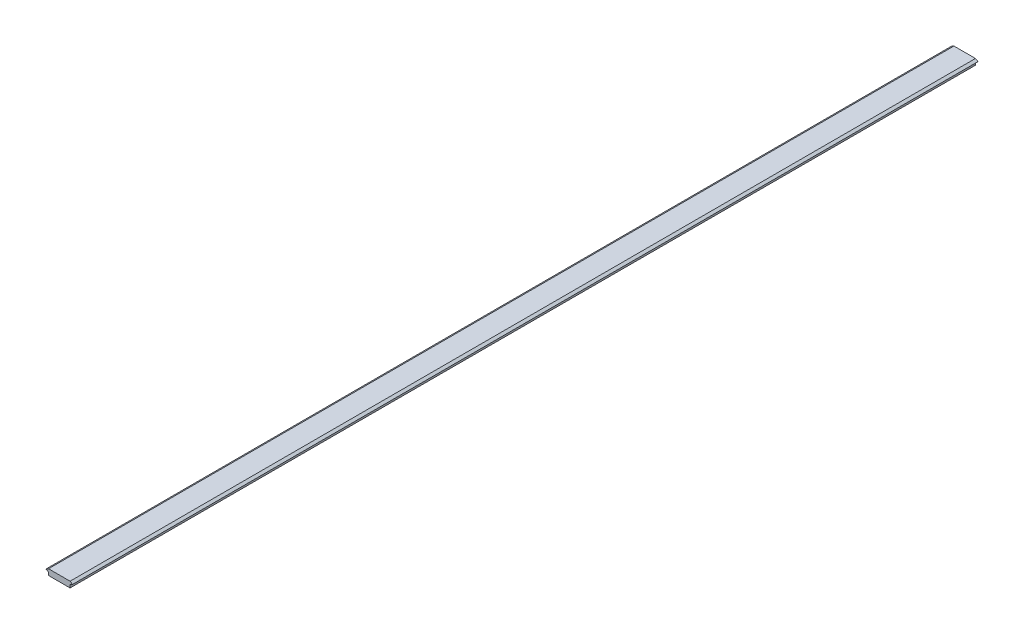
ISO-10303-21;
HEADER;
FILE_DESCRIPTION(('STEP AP214'),'2;1');
FILE_NAME('part.step','',(''),(''),'','','');
FILE_SCHEMA(('AUTOMOTIVE_DESIGN { 1 0 10303 214 1 1 1 1 }'));
ENDSEC;
DATA;
#1=APPLICATION_CONTEXT('core data for automotive mechanical design processes');
#2=APPLICATION_PROTOCOL_DEFINITION('international standard','automotive_design',2000,#1);
#3=PRODUCT_CONTEXT('',#1,'mechanical');
#4=PRODUCT('Part','Part','',(#3));
#5=PRODUCT_RELATED_PRODUCT_CATEGORY('part','',(#4));
#6=PRODUCT_DEFINITION_FORMATION('','',#4);
#7=PRODUCT_DEFINITION_CONTEXT('part definition',#1,'design');
#8=PRODUCT_DEFINITION('design','',#6,#7);
#9=PRODUCT_DEFINITION_SHAPE('','',#8);
#10=(LENGTH_UNIT() NAMED_UNIT(*) SI_UNIT(.MILLI.,.METRE.));
#11=(NAMED_UNIT(*) PLANE_ANGLE_UNIT() SI_UNIT($,.RADIAN.));
#12=(NAMED_UNIT(*) SI_UNIT($,.STERADIAN.) SOLID_ANGLE_UNIT());
#13=UNCERTAINTY_MEASURE_WITH_UNIT(LENGTH_MEASURE(1.E-05),#10,'distance_accuracy_value','');
#14=(GEOMETRIC_REPRESENTATION_CONTEXT(3) GLOBAL_UNCERTAINTY_ASSIGNED_CONTEXT((#13)) GLOBAL_UNIT_ASSIGNED_CONTEXT((#10,
#11,#12)) REPRESENTATION_CONTEXT('',''));
#15=CARTESIAN_POINT('',(0.,0.,0.));
#16=DIRECTION('',(0.,0.,1.));
#17=DIRECTION('',(1.,0.,0.));
#18=AXIS2_PLACEMENT_3D('',#15,#16,#17);
#19=CARTESIAN_POINT('',(-2.59807621135333,-1.5,925.));
#20=DIRECTION('',(0.499999999999998,-0.86602540378444,0.));
#21=DIRECTION('',(0.86602540378444,0.499999999999998,0.));
#22=AXIS2_PLACEMENT_3D('',#19,#20,#21);
#23=PLANE('',#22);
#24=DIRECTION('',(-0.86602540378444,-0.499999999999998,0.));
#25=VECTOR('',#24,1.);
#26=CARTESIAN_POINT('',(-2.59807621135333,-1.5,0.));
#27=LINE('',#26,#25);
#28=CARTESIAN_POINT('',(0.,0.,0.));
#29=VERTEX_POINT('',#28);
#30=CARTESIAN_POINT('',(-2.59807621135333,-1.5,0.));
#31=VERTEX_POINT('',#30);
#32=EDGE_CURVE('E133',#29,#31,#27,.T.);
#33=ORIENTED_EDGE('',*,*,#32,.T.);
#34=DIRECTION('',(0.,0.,-1.));
#35=VECTOR('',#34,1.);
#36=CARTESIAN_POINT('',(-2.59807621135333,-1.5,925.));
#37=LINE('',#36,#35);
#38=CARTESIAN_POINT('',(-2.59807621135333,-1.5,925.));
#39=VERTEX_POINT('',#38);
#40=EDGE_CURVE('E11',#39,#31,#37,.T.);
#41=ORIENTED_EDGE('',*,*,#40,.F.);
#42=DIRECTION('',(-0.86602540378444,-0.499999999999998,0.));
#43=VECTOR('',#42,1.);
#44=CARTESIAN_POINT('',(-2.59807621135333,-1.5,925.));
#45=LINE('',#44,#43);
#46=CARTESIAN_POINT('',(0.,0.,925.));
#47=VERTEX_POINT('',#46);
#48=EDGE_CURVE('E147',#47,#39,#45,.T.);
#49=ORIENTED_EDGE('',*,*,#48,.F.);
#50=DIRECTION('',(0.,0.,-1.));
#51=VECTOR('',#50,1.);
#52=CARTESIAN_POINT('',(0.,0.,925.));
#53=LINE('',#52,#51);
#54=EDGE_CURVE('E129',#47,#29,#53,.T.);
#55=ORIENTED_EDGE('',*,*,#54,.T.);
#56=EDGE_LOOP('',(#33,#41,#49,#55));
#57=FACE_BOUND('',#56,.T.);
#58=ADVANCED_FACE('F37',(#57),#23,.F.);
#59=CARTESIAN_POINT('',(0.,-3.,925.));
#60=DIRECTION('',(0.499999999999998,0.86602540378444,0.));
#61=DIRECTION('',(-0.86602540378444,0.499999999999998,0.));
#62=AXIS2_PLACEMENT_3D('',#59,#60,#61);
#63=PLANE('',#62);
#64=DIRECTION('',(0.86602540378444,-0.499999999999998,0.));
#65=VECTOR('',#64,1.);
#66=CARTESIAN_POINT('',(0.,-3.,0.));
#67=LINE('',#66,#65);
#68=CARTESIAN_POINT('',(0.,-3.,0.));
#69=VERTEX_POINT('',#68);
#70=EDGE_CURVE('E136',#31,#69,#67,.T.);
#71=ORIENTED_EDGE('',*,*,#70,.T.);
#72=DIRECTION('',(0.,0.,-1.));
#73=VECTOR('',#72,1.);
#74=CARTESIAN_POINT('',(0.,-3.,925.));
#75=LINE('',#74,#73);
#76=CARTESIAN_POINT('',(0.,-3.,925.));
#77=VERTEX_POINT('',#76);
#78=EDGE_CURVE('E45',#77,#69,#75,.T.);
#79=ORIENTED_EDGE('',*,*,#78,.F.);
#80=DIRECTION('',(0.86602540378444,-0.499999999999998,0.));
#81=VECTOR('',#80,1.);
#82=CARTESIAN_POINT('',(0.,-3.,925.));
#83=LINE('',#82,#81);
#84=EDGE_CURVE('E96',#39,#77,#83,.T.);
#85=ORIENTED_EDGE('',*,*,#84,.F.);
#86=ORIENTED_EDGE('',*,*,#40,.T.);
#87=EDGE_LOOP('',(#71,#79,#85,#86));
#88=FACE_BOUND('',#87,.T.);
#89=ADVANCED_FACE('F182',(#88),#63,.F.);
#90=CARTESIAN_POINT('',(0.,-6.,925.));
#91=DIRECTION('',(1.,0.,0.));
#92=DIRECTION('',(0.,0.,-1.));
#93=AXIS2_PLACEMENT_3D('',#90,#91,#92);
#94=PLANE('',#93);
#95=DIRECTION('',(0.,-1.,0.));
#96=VECTOR('',#95,1.);
#97=CARTESIAN_POINT('',(0.,-6.,0.));
#98=LINE('',#97,#96);
#99=CARTESIAN_POINT('',(0.,-6.,0.));
#100=VERTEX_POINT('',#99);
#101=EDGE_CURVE('E138',#69,#100,#98,.T.);
#102=ORIENTED_EDGE('',*,*,#101,.T.);
#103=DIRECTION('',(0.,0.,-1.));
#104=VECTOR('',#103,1.);
#105=CARTESIAN_POINT('',(0.,-6.,925.));
#106=LINE('',#105,#104);
#107=CARTESIAN_POINT('',(0.,-6.,925.));
#108=VERTEX_POINT('',#107);
#109=EDGE_CURVE('E154',#108,#100,#106,.T.);
#110=ORIENTED_EDGE('',*,*,#109,.F.);
#111=DIRECTION('',(0.,-1.,0.));
#112=VECTOR('',#111,1.);
#113=CARTESIAN_POINT('',(0.,-6.,925.));
#114=LINE('',#113,#112);
#115=EDGE_CURVE('E162',#77,#108,#114,.T.);
#116=ORIENTED_EDGE('',*,*,#115,.F.);
#117=ORIENTED_EDGE('',*,*,#78,.T.);
#118=EDGE_LOOP('',(#102,#110,#116,#117));
#119=FACE_BOUND('',#118,.T.);
#120=ADVANCED_FACE('F160',(#119),#94,.F.);
#121=CARTESIAN_POINT('',(22.,-6.,925.));
#122=DIRECTION('',(0.,1.,0.));
#123=DIRECTION('',(0.,0.,1.));
#124=AXIS2_PLACEMENT_3D('',#121,#122,#123);
#125=PLANE('',#124);
#126=DIRECTION('',(1.,0.,0.));
#127=VECTOR('',#126,1.);
#128=CARTESIAN_POINT('',(22.,-6.,0.));
#129=LINE('',#128,#127);
#130=CARTESIAN_POINT('',(22.,-6.,0.));
#131=VERTEX_POINT('',#130);
#132=EDGE_CURVE('E140',#100,#131,#129,.T.);
#133=ORIENTED_EDGE('',*,*,#132,.T.);
#134=DIRECTION('',(0.,0.,-1.));
#135=VECTOR('',#134,1.);
#136=CARTESIAN_POINT('',(22.,-6.,925.));
#137=LINE('',#136,#135);
#138=CARTESIAN_POINT('',(22.,-6.,925.));
#139=VERTEX_POINT('',#138);
#140=EDGE_CURVE('E151',#139,#131,#137,.T.);
#141=ORIENTED_EDGE('',*,*,#140,.F.);
#142=DIRECTION('',(1.,0.,0.));
#143=VECTOR('',#142,1.);
#144=CARTESIAN_POINT('',(22.,-6.,925.));
#145=LINE('',#144,#143);
#146=EDGE_CURVE('E174',#108,#139,#145,.T.);
#147=ORIENTED_EDGE('',*,*,#146,.F.);
#148=ORIENTED_EDGE('',*,*,#109,.T.);
#149=EDGE_LOOP('',(#133,#141,#147,#148));
#150=FACE_BOUND('',#149,.T.);
#151=ADVANCED_FACE('F170',(#150),#125,.F.);
#152=CARTESIAN_POINT('',(22.,-3.,925.));
#153=DIRECTION('',(-1.,0.,0.));
#154=DIRECTION('',(0.,0.,1.));
#155=AXIS2_PLACEMENT_3D('',#152,#153,#154);
#156=PLANE('',#155);
#157=DIRECTION('',(0.,1.,0.));
#158=VECTOR('',#157,1.);
#159=CARTESIAN_POINT('',(22.,-3.,0.));
#160=LINE('',#159,#158);
#161=CARTESIAN_POINT('',(22.,-3.,0.));
#162=VERTEX_POINT('',#161);
#163=EDGE_CURVE('E142',#131,#162,#160,.T.);
#164=ORIENTED_EDGE('',*,*,#163,.T.);
#165=DIRECTION('',(0.,0.,-1.));
#166=VECTOR('',#165,1.);
#167=CARTESIAN_POINT('',(22.,-3.,925.));
#168=LINE('',#167,#166);
#169=CARTESIAN_POINT('',(22.,-3.,925.));
#170=VERTEX_POINT('',#169);
#171=EDGE_CURVE('E124',#170,#162,#168,.T.);
#172=ORIENTED_EDGE('',*,*,#171,.F.);
#173=DIRECTION('',(0.,1.,0.));
#174=VECTOR('',#173,1.);
#175=CARTESIAN_POINT('',(22.,-3.,925.));
#176=LINE('',#175,#174);
#177=EDGE_CURVE('E115',#139,#170,#176,.T.);
#178=ORIENTED_EDGE('',*,*,#177,.F.);
#179=ORIENTED_EDGE('',*,*,#140,.T.);
#180=EDGE_LOOP('',(#164,#172,#178,#179));
#181=FACE_BOUND('',#180,.T.);
#182=ADVANCED_FACE('F173',(#181),#156,.F.);
#183=CARTESIAN_POINT('',(24.5980762113533,-1.5,925.));
#184=DIRECTION('',(-0.499999999999998,0.86602540378444,0.));
#185=DIRECTION('',(-0.86602540378444,-0.499999999999998,0.));
#186=AXIS2_PLACEMENT_3D('',#183,#184,#185);
#187=PLANE('',#186);
#188=DIRECTION('',(0.86602540378444,0.499999999999998,0.));
#189=VECTOR('',#188,1.);
#190=CARTESIAN_POINT('',(24.5980762113533,-1.5,0.));
#191=LINE('',#190,#189);
#192=CARTESIAN_POINT('',(24.5980762113533,-1.5,0.));
#193=VERTEX_POINT('',#192);
#194=EDGE_CURVE('E123',#162,#193,#191,.T.);
#195=ORIENTED_EDGE('',*,*,#194,.T.);
#196=DIRECTION('',(0.,0.,-1.));
#197=VECTOR('',#196,1.);
#198=CARTESIAN_POINT('',(24.5980762113533,-1.5,925.));
#199=LINE('',#198,#197);
#200=CARTESIAN_POINT('',(24.5980762113533,-1.5,925.));
#201=VERTEX_POINT('',#200);
#202=EDGE_CURVE('E120',#201,#193,#199,.T.);
#203=ORIENTED_EDGE('',*,*,#202,.F.);
#204=DIRECTION('',(0.86602540378444,0.499999999999998,0.));
#205=VECTOR('',#204,1.);
#206=CARTESIAN_POINT('',(24.5980762113533,-1.5,925.));
#207=LINE('',#206,#205);
#208=EDGE_CURVE('E109',#170,#201,#207,.T.);
#209=ORIENTED_EDGE('',*,*,#208,.F.);
#210=ORIENTED_EDGE('',*,*,#171,.T.);
#211=EDGE_LOOP('',(#195,#203,#209,#210));
#212=FACE_BOUND('',#211,.T.);
#213=ADVANCED_FACE('F121',(#212),#187,.F.);
#214=CARTESIAN_POINT('',(22.,0.,925.));
#215=DIRECTION('',(-0.499999999999998,-0.86602540378444,0.));
#216=DIRECTION('',(0.86602540378444,-0.499999999999998,0.));
#217=AXIS2_PLACEMENT_3D('',#214,#215,#216);
#218=PLANE('',#217);
#219=DIRECTION('',(-0.86602540378444,0.499999999999998,0.));
#220=VECTOR('',#219,1.);
#221=CARTESIAN_POINT('',(22.,0.,0.));
#222=LINE('',#221,#220);
#223=CARTESIAN_POINT('',(22.,0.,0.));
#224=VERTEX_POINT('',#223);
#225=EDGE_CURVE('E82',#193,#224,#222,.T.);
#226=ORIENTED_EDGE('',*,*,#225,.T.);
#227=DIRECTION('',(0.,0.,-1.));
#228=VECTOR('',#227,1.);
#229=CARTESIAN_POINT('',(22.,0.,925.));
#230=LINE('',#229,#228);
#231=CARTESIAN_POINT('',(22.,0.,925.));
#232=VERTEX_POINT('',#231);
#233=EDGE_CURVE('E125',#232,#224,#230,.T.);
#234=ORIENTED_EDGE('',*,*,#233,.F.);
#235=DIRECTION('',(-0.86602540378444,0.499999999999998,0.));
#236=VECTOR('',#235,1.);
#237=CARTESIAN_POINT('',(22.,0.,925.));
#238=LINE('',#237,#236);
#239=EDGE_CURVE('E113',#201,#232,#238,.T.);
#240=ORIENTED_EDGE('',*,*,#239,.F.);
#241=ORIENTED_EDGE('',*,*,#202,.T.);
#242=EDGE_LOOP('',(#226,#234,#240,#241));
#243=FACE_BOUND('',#242,.T.);
#244=ADVANCED_FACE('F127',(#243),#218,.F.);
#245=CARTESIAN_POINT('',(0.,0.,925.));
#246=DIRECTION('',(0.,-1.,0.));
#247=DIRECTION('',(0.,0.,-1.));
#248=AXIS2_PLACEMENT_3D('',#245,#246,#247);
#249=PLANE('',#248);
#250=DIRECTION('',(-1.,0.,0.));
#251=VECTOR('',#250,1.);
#252=CARTESIAN_POINT('',(0.,0.,0.));
#253=LINE('',#252,#251);
#254=EDGE_CURVE('E88',#224,#29,#253,.T.);
#255=ORIENTED_EDGE('',*,*,#254,.T.);
#256=ORIENTED_EDGE('',*,*,#54,.F.);
#257=DIRECTION('',(-1.,0.,0.));
#258=VECTOR('',#257,1.);
#259=CARTESIAN_POINT('',(0.,0.,925.));
#260=LINE('',#259,#258);
#261=EDGE_CURVE('E53',#232,#47,#260,.T.);
#262=ORIENTED_EDGE('',*,*,#261,.F.);
#263=ORIENTED_EDGE('',*,*,#233,.T.);
#264=EDGE_LOOP('',(#255,#256,#262,#263));
#265=FACE_BOUND('',#264,.T.);
#266=ADVANCED_FACE('F198',(#265),#249,.F.);
#267=CARTESIAN_POINT('',(0.,0.,925.));
#268=DIRECTION('',(0.,0.,-1.));
#269=DIRECTION('',(-1.,0.,0.));
#270=AXIS2_PLACEMENT_3D('',#267,#268,#269);
#271=PLANE('',#270);
#272=ORIENTED_EDGE('',*,*,#48,.T.);
#273=ORIENTED_EDGE('',*,*,#84,.T.);
#274=ORIENTED_EDGE('',*,*,#115,.T.);
#275=ORIENTED_EDGE('',*,*,#146,.T.);
#276=ORIENTED_EDGE('',*,*,#177,.T.);
#277=ORIENTED_EDGE('',*,*,#208,.T.);
#278=ORIENTED_EDGE('',*,*,#239,.T.);
#279=ORIENTED_EDGE('',*,*,#261,.T.);
#280=EDGE_LOOP('',(#272,#273,#274,#275,#276,#277,#278,#279));
#281=FACE_BOUND('',#280,.T.);
#282=ADVANCED_FACE('F111',(#281),#271,.F.);
#283=CARTESIAN_POINT('',(0.,0.,0.));
#284=DIRECTION('',(0.,0.,-1.));
#285=DIRECTION('',(-1.,0.,0.));
#286=AXIS2_PLACEMENT_3D('',#283,#284,#285);
#287=PLANE('',#286);
#288=ORIENTED_EDGE('',*,*,#32,.F.);
#289=ORIENTED_EDGE('',*,*,#254,.F.);
#290=ORIENTED_EDGE('',*,*,#225,.F.);
#291=ORIENTED_EDGE('',*,*,#194,.F.);
#292=ORIENTED_EDGE('',*,*,#163,.F.);
#293=ORIENTED_EDGE('',*,*,#132,.F.);
#294=ORIENTED_EDGE('',*,*,#101,.F.);
#295=ORIENTED_EDGE('',*,*,#70,.F.);
#296=EDGE_LOOP('',(#288,#289,#290,#291,#292,#293,#294,#295));
#297=FACE_BOUND('',#296,.T.);
#298=ADVANCED_FACE('F166',(#297),#287,.T.);
#299=CLOSED_SHELL('',(#58,#89,#120,#151,#182,#213,#244,#266,#282,#298));
#300=MANIFOLD_SOLID_BREP('B2',#299);
#301=ADVANCED_BREP_SHAPE_REPRESENTATION('',(#18,#300),#14);
#302=SHAPE_DEFINITION_REPRESENTATION(#9,#301);
ENDSEC;
END-ISO-10303-21;
